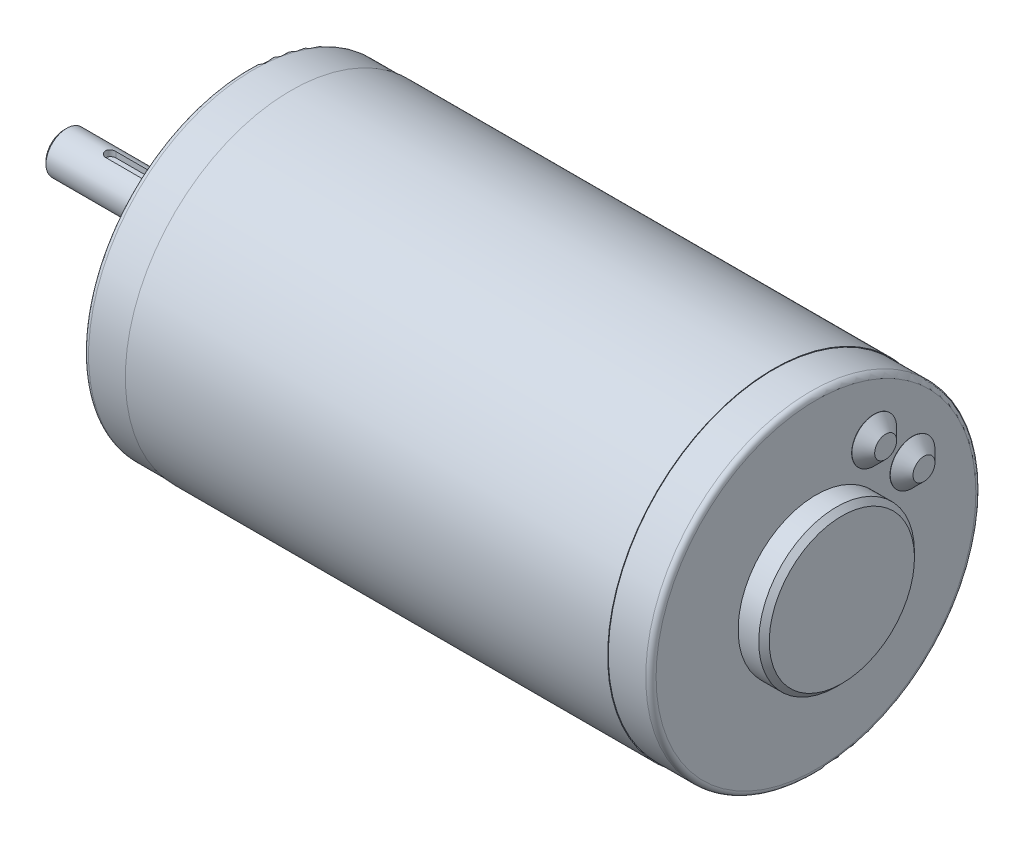
ISO-10303-21;
HEADER;
FILE_DESCRIPTION(('STEP AP214'),'2;1');
FILE_NAME('part.step','',(''),(''),'','','');
FILE_SCHEMA(('AUTOMOTIVE_DESIGN { 1 0 10303 214 1 1 1 1 }'));
ENDSEC;
DATA;
#1=APPLICATION_CONTEXT('core data for automotive mechanical design processes');
#2=APPLICATION_PROTOCOL_DEFINITION('international standard','automotive_design',2000,#1);
#3=PRODUCT_CONTEXT('',#1,'mechanical');
#4=PRODUCT('Part','Part','',(#3));
#5=PRODUCT_RELATED_PRODUCT_CATEGORY('part','',(#4));
#6=PRODUCT_DEFINITION_FORMATION('','',#4);
#7=PRODUCT_DEFINITION_CONTEXT('part definition',#1,'design');
#8=PRODUCT_DEFINITION('design','',#6,#7);
#9=PRODUCT_DEFINITION_SHAPE('','',#8);
#10=(LENGTH_UNIT() NAMED_UNIT(*) SI_UNIT(.MILLI.,.METRE.));
#11=(NAMED_UNIT(*) PLANE_ANGLE_UNIT() SI_UNIT($,.RADIAN.));
#12=(NAMED_UNIT(*) SI_UNIT($,.STERADIAN.) SOLID_ANGLE_UNIT());
#13=UNCERTAINTY_MEASURE_WITH_UNIT(LENGTH_MEASURE(1.E-05),#10,'distance_accuracy_value','');
#14=(GEOMETRIC_REPRESENTATION_CONTEXT(3) GLOBAL_UNCERTAINTY_ASSIGNED_CONTEXT((#13)) GLOBAL_UNIT_ASSIGNED_CONTEXT((#10,
#11,#12)) REPRESENTATION_CONTEXT('',''));
#15=CARTESIAN_POINT('',(0.,0.,0.));
#16=DIRECTION('',(0.,0.,1.));
#17=DIRECTION('',(1.,0.,0.));
#18=AXIS2_PLACEMENT_3D('',#15,#16,#17);
#19=CARTESIAN_POINT('',(-27.6,2.79999999999999,-1.));
#20=DIRECTION('',(0.,-1.,0.));
#21=DIRECTION('',(0.,0.,-1.));
#22=AXIS2_PLACEMENT_3D('',#19,#20,#21);
#23=PLANE('',#22);
#24=CARTESIAN_POINT('',(-7.1,2.79999999999999,0.));
#25=DIRECTION('',(0.,1.,0.));
#26=DIRECTION('',(0.,0.,1.));
#27=AXIS2_PLACEMENT_3D('',#24,#25,#26);
#28=CIRCLE('',#27,1.);
#29=CARTESIAN_POINT('',(-7.1,2.79999999999999,1.));
#30=VERTEX_POINT('',#29);
#31=CARTESIAN_POINT('',(-7.1,2.79999999999999,-1.));
#32=VERTEX_POINT('',#31);
#33=EDGE_CURVE('E81',#30,#32,#28,.T.);
#34=ORIENTED_EDGE('',*,*,#33,.T.);
#35=DIRECTION('',(1.,0.,0.));
#36=VECTOR('',#35,1.);
#37=CARTESIAN_POINT('',(-27.6,2.79999999999999,-1.));
#38=LINE('',#37,#36);
#39=CARTESIAN_POINT('',(-26.6,2.79999999999999,-1.));
#40=VERTEX_POINT('',#39);
#41=EDGE_CURVE('E76',#40,#32,#38,.T.);
#42=ORIENTED_EDGE('',*,*,#41,.F.);
#43=CARTESIAN_POINT('',(-26.6,2.79999999999999,0.));
#44=DIRECTION('',(0.,-1.,0.));
#45=DIRECTION('',(0.,0.,-1.));
#46=AXIS2_PLACEMENT_3D('',#43,#44,#45);
#47=CIRCLE('',#46,1.);
#48=CARTESIAN_POINT('',(-26.6,2.79999999999999,1.));
#49=VERTEX_POINT('',#48);
#50=EDGE_CURVE('E78',#40,#49,#47,.F.);
#51=ORIENTED_EDGE('',*,*,#50,.T.);
#52=DIRECTION('',(1.,0.,0.));
#53=VECTOR('',#52,1.);
#54=CARTESIAN_POINT('',(-27.6,2.79999999999999,1.));
#55=LINE('',#54,#53);
#56=EDGE_CURVE('E104',#49,#30,#55,.T.);
#57=ORIENTED_EDGE('',*,*,#56,.T.);
#58=EDGE_LOOP('',(#34,#42,#51,#57));
#59=FACE_BOUND('',#58,.T.);
#60=ADVANCED_FACE('F18',(#59),#23,.F.);
#61=CARTESIAN_POINT('',(-35.6,0.,0.));
#62=DIRECTION('',(-1.,0.,0.));
#63=DIRECTION('',(0.,0.,1.));
#64=AXIS2_PLACEMENT_3D('',#61,#62,#63);
#65=PLANE('',#64);
#66=CARTESIAN_POINT('',(-35.6000000000449,0.,0.));
#67=DIRECTION('',(1.,0.,0.));
#68=DIRECTION('',(0.,0.,-1.));
#69=AXIS2_PLACEMENT_3D('',#66,#67,#68);
#70=CIRCLE('',#69,3.49999999997408);
#71=CARTESIAN_POINT('',(-35.6000000000449,0.,-3.49999999997408));
#72=VERTEX_POINT('',#71);
#73=EDGE_CURVE('E326',#72,#72,#70,.T.);
#74=ORIENTED_EDGE('',*,*,#73,.F.);
#75=EDGE_LOOP('',(#74));
#76=FACE_BOUND('',#75,.T.);
#77=ADVANCED_FACE('F610',(#76),#65,.T.);
#78=CARTESIAN_POINT('',(-26.6,3.87298334620741,0.));
#79=DIRECTION('',(0.,-1.,0.));
#80=DIRECTION('',(0.,0.,-1.));
#81=AXIS2_PLACEMENT_3D('',#78,#79,#80);
#82=CYLINDRICAL_SURFACE('',#81,1.);
#83=CARTESIAN_POINT('',(-26.6,3.87298334620741,1.));
#84=CARTESIAN_POINT('',(-26.6276629851065,3.87298148580177,1.00000033749611));
#85=CARTESIAN_POINT('',(-26.6553122630182,3.8732800994947,0.998851407375366));
#86=CARTESIAN_POINT('',(-26.7104040353036,3.87445904774558,0.994271295395754));
#87=CARTESIAN_POINT('',(-26.7378465636871,3.87533928441687,0.990840497572679));
#88=CARTESIAN_POINT('',(-26.8194531732088,3.87881710972053,0.977175239382526));
#89=CARTESIAN_POINT('',(-26.8730564684822,3.88225203148808,0.963567695172493));
#90=CARTESIAN_POINT('',(-26.977124673782,3.89095422588002,0.927798076247996));
#91=CARTESIAN_POINT('',(-27.0275898782129,3.89622132630929,0.905636805423835));
#92=CARTESIAN_POINT('',(-27.1241114486473,3.90799134471939,0.853415378025864));
#93=CARTESIAN_POINT('',(-27.170166627891,3.91449459395647,0.823353103356932));
#94=CARTESIAN_POINT('',(-27.2575438819061,3.92816262398025,0.755484471828069));
#95=CARTESIAN_POINT('',(-27.2987548862455,3.93533791028915,0.717537268783975));
#96=CARTESIAN_POINT('',(-27.3743020894827,3.94945104396193,0.635275780516229));
#97=CARTESIAN_POINT('',(-27.4086371894679,3.95638885322537,0.59096047947883));
#98=CARTESIAN_POINT('',(-27.4699110016186,3.96936182283248,0.496456899401689));
#99=CARTESIAN_POINT('',(-27.496739895984,3.9753830468173,0.446195340334472));
#100=CARTESIAN_POINT('',(-27.5415247341967,3.98572346250588,0.341702590842916));
#101=CARTESIAN_POINT('',(-27.5594824242998,3.990042989147,0.287472184083007));
#102=CARTESIAN_POINT('',(-27.5856589927774,3.99641900005128,0.177744108525158));
#103=CARTESIAN_POINT('',(-27.5940676724228,3.998519529013,0.122294322002856));
#104=CARTESIAN_POINT('',(-27.6015033715433,4.00037438150815,0.0107327756816781));
#105=CARTESIAN_POINT('',(-27.6005315701923,4.00012899993444,-0.0453789000287067));
#106=CARTESIAN_POINT('',(-27.5893700363146,3.99735237365735,-0.155352492972096));
#107=CARTESIAN_POINT('',(-27.5793853834005,3.9948719867736,-0.209236701739855));
#108=CARTESIAN_POINT('',(-27.5508113208173,3.98796330636495,-0.31453871108434));
#109=CARTESIAN_POINT('',(-27.5322215304314,3.98353492665556,-0.365956402423988));
#110=CARTESIAN_POINT('',(-27.4867987193294,3.97314997761798,-0.46540728602454));
#111=CARTESIAN_POINT('',(-27.4598926057672,3.96717993827555,-0.513405629602248));
#112=CARTESIAN_POINT('',(-27.3986568701665,3.95435945541919,-0.604276631230015));
#113=CARTESIAN_POINT('',(-27.3643261297468,3.94750887933198,-0.64714851556229));
#114=CARTESIAN_POINT('',(-27.2881210879187,3.93345566022865,-0.727769389708492));
#115=CARTESIAN_POINT('',(-27.2460683634602,3.92624850477685,-0.765349103054128));
#116=CARTESIAN_POINT('',(-27.1561701330723,3.91246168284006,-0.832969575186237));
#117=CARTESIAN_POINT('',(-27.1083230467164,3.90588218842993,-0.863008270245062));
#118=CARTESIAN_POINT('',(-27.0078544021762,3.89407813586325,-0.914804709285961));
#119=CARTESIAN_POINT('',(-26.9552085351039,3.88886106009136,-0.936517017887269));
#120=CARTESIAN_POINT('',(-26.8468830715817,3.88047058807054,-0.970702351849828));
#121=CARTESIAN_POINT('',(-26.7912081448502,3.87729413761435,-0.983189189212131));
#122=CARTESIAN_POINT('',(-26.7125426192411,3.87455290681524,-0.993904635150938));
#123=CARTESIAN_POINT('',(-26.6900802967868,3.87396523110859,-0.996190790966708));
#124=CARTESIAN_POINT('',(-26.6450822100907,3.87318062488974,-0.999236757697394));
#125=CARTESIAN_POINT('',(-26.6225466240447,3.87298306219461,-0.999999038096045));
#126=CARTESIAN_POINT('',(-26.6,3.87298334620741,-1.));
#127=B_SPLINE_CURVE_WITH_KNOTS('',3,(#83,#84,#85,#86,#87,#88,#89,#90,#91,#92,#93,#94,#95,#96,
#97,#98,#99,#100,#101,#102,#103,#104,#105,#106,#107,#108,#109,#110,#111,#112,#113,#114,#115,
#116,#117,#118,#119,#120,#121,#122,#123,#124,#125,#126),.UNSPECIFIED.,.F.,.F.,(4,2,2,2,2,2,2,2,
2,2,2,2,2,2,2,2,2,2,2,2,2,4),(0.,0.0829365303397727,0.165859106084653,0.331229963080318,
0.496585282091499,0.661984974726751,0.830641897427976,0.999325753539196,1.17036187098235,
1.34136430732425,1.50890481515325,1.67642426256639,1.84022545479276,2.00403389475838,
2.16932509450376,2.33464120964329,2.50441429534542,2.67423379180967,2.84496720161068,
3.01544447539986,3.08315848722649,3.15076267731671),.UNSPECIFIED.);
#128=CARTESIAN_POINT('',(-26.6,3.87298334620741,1.));
#129=VERTEX_POINT('',#128);
#130=CARTESIAN_POINT('',(-26.6,3.87298334620741,-1.));
#131=VERTEX_POINT('',#130);
#132=EDGE_CURVE('E162',#129,#131,#127,.T.);
#133=ORIENTED_EDGE('',*,*,#132,.F.);
#134=DIRECTION('',(0.,1.,0.));
#135=VECTOR('',#134,1.);
#136=CARTESIAN_POINT('',(-26.6,2.79999999999999,1.));
#137=LINE('',#136,#135);
#138=EDGE_CURVE('E91',#129,#49,#137,.F.);
#139=ORIENTED_EDGE('',*,*,#138,.T.);
#140=ORIENTED_EDGE('',*,*,#50,.F.);
#141=DIRECTION('',(0.,1.,0.));
#142=VECTOR('',#141,1.);
#143=CARTESIAN_POINT('',(-26.6,2.79999999999999,-1.));
#144=LINE('',#143,#142);
#145=EDGE_CURVE('E85',#131,#40,#144,.F.);
#146=ORIENTED_EDGE('',*,*,#145,.F.);
#147=EDGE_LOOP('',(#133,#139,#140,#146));
#148=FACE_BOUND('',#147,.T.);
#149=ADVANCED_FACE('F88',(#148),#82,.F.);
#150=CARTESIAN_POINT('',(-27.6,2.79999999999999,-1.));
#151=DIRECTION('',(0.,0.,1.));
#152=DIRECTION('',(1.,0.,0.));
#153=AXIS2_PLACEMENT_3D('',#150,#151,#152);
#154=PLANE('',#153);
#155=DIRECTION('',(1.,0.,0.));
#156=VECTOR('',#155,1.);
#157=CARTESIAN_POINT('',(0.,3.87298334620741,-1.));
#158=LINE('',#157,#156);
#159=CARTESIAN_POINT('',(-7.1,3.87298334620741,-1.));
#160=VERTEX_POINT('',#159);
#161=EDGE_CURVE('E96',#131,#160,#158,.T.);
#162=ORIENTED_EDGE('',*,*,#161,.F.);
#163=ORIENTED_EDGE('',*,*,#145,.T.);
#164=ORIENTED_EDGE('',*,*,#41,.T.);
#165=DIRECTION('',(0.,1.,0.));
#166=VECTOR('',#165,1.);
#167=CARTESIAN_POINT('',(-7.1,2.79999999999999,-1.));
#168=LINE('',#167,#166);
#169=EDGE_CURVE('E99',#32,#160,#168,.T.);
#170=ORIENTED_EDGE('',*,*,#169,.T.);
#171=EDGE_LOOP('',(#162,#163,#164,#170));
#172=FACE_BOUND('',#171,.T.);
#173=ADVANCED_FACE('F94',(#172),#154,.T.);
#174=CARTESIAN_POINT('',(-7.1,2.79999999999999,0.));
#175=DIRECTION('',(0.,1.,0.));
#176=DIRECTION('',(0.,0.,1.));
#177=AXIS2_PLACEMENT_3D('',#174,#175,#176);
#178=CYLINDRICAL_SURFACE('',#177,1.);
#179=ORIENTED_EDGE('',*,*,#33,.F.);
#180=DIRECTION('',(0.,1.,0.));
#181=VECTOR('',#180,1.);
#182=CARTESIAN_POINT('',(-7.1,2.79999999999999,1.));
#183=LINE('',#182,#181);
#184=CARTESIAN_POINT('',(-7.1,3.87298334620741,1.));
#185=VERTEX_POINT('',#184);
#186=EDGE_CURVE('E105',#30,#185,#183,.T.);
#187=ORIENTED_EDGE('',*,*,#186,.T.);
#188=CARTESIAN_POINT('',(-7.1,3.87298334620741,-1.));
#189=CARTESIAN_POINT('',(-7.07233701489346,3.87298148580177,-1.00000033749611));
#190=CARTESIAN_POINT('',(-7.04468773698177,3.8732800994947,-0.998851407375366));
#191=CARTESIAN_POINT('',(-6.98959596469644,3.87445904774558,-0.994271295395754));
#192=CARTESIAN_POINT('',(-6.96215343631291,3.87533928441687,-0.990840497572679));
#193=CARTESIAN_POINT('',(-6.88054682679116,3.87881710972053,-0.977175239382526));
#194=CARTESIAN_POINT('',(-6.82694353151779,3.88225203148808,-0.963567695172493));
#195=CARTESIAN_POINT('',(-6.72287532621804,3.89095422588002,-0.927798076247997));
#196=CARTESIAN_POINT('',(-6.67241012178714,3.89622132630929,-0.905636805423836));
#197=CARTESIAN_POINT('',(-6.57588855135267,3.90799134471939,-0.853415378025865));
#198=CARTESIAN_POINT('',(-6.52983337210904,3.91449459395647,-0.823353103356933));
#199=CARTESIAN_POINT('',(-6.4424561180939,3.92816262398025,-0.755484471828069));
#200=CARTESIAN_POINT('',(-6.40124511375448,3.93533791028915,-0.717537268783976));
#201=CARTESIAN_POINT('',(-6.32569791051729,3.94945104396193,-0.63527578051623));
#202=CARTESIAN_POINT('',(-6.29136281053206,3.95638885322537,-0.590960479478831));
#203=CARTESIAN_POINT('',(-6.23008899838136,3.96936182283248,-0.496456899401691));
#204=CARTESIAN_POINT('',(-6.20326010401603,3.9753830468173,-0.446195340334474));
#205=CARTESIAN_POINT('',(-6.1584752658033,3.98572346250588,-0.341702590842919));
#206=CARTESIAN_POINT('',(-6.14051757570017,3.990042989147,-0.28747218408301));
#207=CARTESIAN_POINT('',(-6.11434100722257,3.99641900005128,-0.17774410852516));
#208=CARTESIAN_POINT('',(-6.10593232757718,3.998519529013,-0.122294322002858));
#209=CARTESIAN_POINT('',(-6.09849662845671,4.00037438150815,-0.0107327756816796));
#210=CARTESIAN_POINT('',(-6.09946842980766,4.00012899993444,0.0453789000287057));
#211=CARTESIAN_POINT('',(-6.11062996368545,3.99735237365735,0.155352492972096));
#212=CARTESIAN_POINT('',(-6.12061461659948,3.9948719867736,0.209236701739855));
#213=CARTESIAN_POINT('',(-6.14918867918275,3.98796330636495,0.31453871108434));
#214=CARTESIAN_POINT('',(-6.16777846956858,3.98353492665556,0.365956402423988));
#215=CARTESIAN_POINT('',(-6.21320128067065,3.97314997761798,0.465407286024539));
#216=CARTESIAN_POINT('',(-6.24010739423284,3.96717993827555,0.513405629602248));
#217=CARTESIAN_POINT('',(-6.30134312983347,3.95435945541919,0.604276631230014));
#218=CARTESIAN_POINT('',(-6.33567387025322,3.94750887933198,0.647148515562289));
#219=CARTESIAN_POINT('',(-6.41187891208131,3.93345566022865,0.72776938970849));
#220=CARTESIAN_POINT('',(-6.45393163653981,3.92624850477685,0.765349103054127));
#221=CARTESIAN_POINT('',(-6.54382986692773,3.91246168284006,0.832969575186237));
#222=CARTESIAN_POINT('',(-6.59167695328356,3.90588218842993,0.863008270245062));
#223=CARTESIAN_POINT('',(-6.69214559782377,3.89407813586325,0.914804709285962));
#224=CARTESIAN_POINT('',(-6.74479146489609,3.88886106009136,0.936517017887269));
#225=CARTESIAN_POINT('',(-6.85311692841829,3.88047058807055,0.970702351849829));
#226=CARTESIAN_POINT('',(-6.90879185514984,3.87729413761435,0.983189189212132));
#227=CARTESIAN_POINT('',(-6.9874573807589,3.87455290681524,0.993904635150938));
#228=CARTESIAN_POINT('',(-7.00991970321318,3.87396523110859,0.996190790966708));
#229=CARTESIAN_POINT('',(-7.05491778990932,3.87318062488974,0.999236757697394));
#230=CARTESIAN_POINT('',(-7.07745337595529,3.87298306219461,0.999999038096045));
#231=CARTESIAN_POINT('',(-7.1,3.87298334620741,1.));
#232=B_SPLINE_CURVE_WITH_KNOTS('',3,(#188,#189,#190,#191,#192,#193,#194,#195,#196,#197,#198,
#199,#200,#201,#202,#203,#204,#205,#206,#207,#208,#209,#210,#211,#212,#213,#214,#215,#216,#217,
#218,#219,#220,#221,#222,#223,#224,#225,#226,#227,#228,#229,#230,#231),.UNSPECIFIED.,.F.,.F.,(4,
2,2,2,2,2,2,2,2,2,2,2,2,2,2,2,2,2,2,2,2,4),(0.,0.0829365303397693,0.165859106084651,
0.331229963080317,0.496585282091498,0.661984974726749,0.830641897427974,0.999325753539193,
1.17036187098235,1.34136430732424,1.50890481515325,1.67642426256639,1.84022545479276,
2.00403389475838,2.16932509450376,2.33464120964329,2.50441429534542,2.67423379180967,
2.84496720161068,3.01544447539986,3.08315848722648,3.15076267731671),.UNSPECIFIED.);
#233=EDGE_CURVE('E153',#160,#185,#232,.T.);
#234=ORIENTED_EDGE('',*,*,#233,.F.);
#235=ORIENTED_EDGE('',*,*,#169,.F.);
#236=EDGE_LOOP('',(#179,#187,#234,#235));
#237=FACE_BOUND('',#236,.T.);
#238=ADVANCED_FACE('F168',(#237),#178,.F.);
#239=CARTESIAN_POINT('',(-27.6,2.79999999999999,1.));
#240=DIRECTION('',(0.,0.,1.));
#241=DIRECTION('',(1.,0.,0.));
#242=AXIS2_PLACEMENT_3D('',#239,#240,#241);
#243=PLANE('',#242);
#244=ORIENTED_EDGE('',*,*,#186,.F.);
#245=ORIENTED_EDGE('',*,*,#56,.F.);
#246=ORIENTED_EDGE('',*,*,#138,.F.);
#247=DIRECTION('',(1.,0.,0.));
#248=VECTOR('',#247,1.);
#249=CARTESIAN_POINT('',(0.,3.87298334620741,1.));
#250=LINE('',#249,#248);
#251=EDGE_CURVE('E161',#185,#129,#250,.F.);
#252=ORIENTED_EDGE('',*,*,#251,.F.);
#253=EDGE_LOOP('',(#244,#245,#246,#252));
#254=FACE_BOUND('',#253,.T.);
#255=ADVANCED_FACE('F183',(#254),#243,.F.);
#256=CARTESIAN_POINT('',(-35.0999999999999,0.,0.));
#257=DIRECTION('',(1.,0.,0.));
#258=DIRECTION('',(0.,0.,-1.));
#259=AXIS2_PLACEMENT_3D('',#256,#257,#258);
#260=CONICAL_SURFACE('',#259,3.99999999996226,0.785398163340605);
#261=ORIENTED_EDGE('',*,*,#73,.T.);
#262=EDGE_LOOP('',(#261));
#263=FACE_BOUND('',#262,.T.);
#264=CARTESIAN_POINT('',(-35.1,0.,0.));
#265=DIRECTION('',(1.,0.,0.));
#266=DIRECTION('',(0.,0.,-1.));
#267=AXIS2_PLACEMENT_3D('',#264,#265,#266);
#268=CIRCLE('',#267,4.);
#269=CARTESIAN_POINT('',(-35.1,0.,-4.));
#270=VERTEX_POINT('',#269);
#271=EDGE_CURVE('E152',#270,#270,#268,.T.);
#272=ORIENTED_EDGE('',*,*,#271,.F.);
#273=EDGE_LOOP('',(#272));
#274=FACE_BOUND('',#273,.T.);
#275=ADVANCED_FACE('F178',(#263,#274),#260,.T.);
#276=CARTESIAN_POINT('',(0.,0.,0.));
#277=DIRECTION('',(1.,0.,0.));
#278=DIRECTION('',(0.,0.,-1.));
#279=AXIS2_PLACEMENT_3D('',#276,#277,#278);
#280=CYLINDRICAL_SURFACE('',#279,4.);
#281=ORIENTED_EDGE('',*,*,#271,.T.);
#282=EDGE_LOOP('',(#281));
#283=FACE_BOUND('',#282,.T.);
#284=CARTESIAN_POINT('',(-4.,0.,0.));
#285=DIRECTION('',(1.,0.,0.));
#286=DIRECTION('',(0.,0.,-1.));
#287=AXIS2_PLACEMENT_3D('',#284,#285,#286);
#288=CIRCLE('',#287,4.);
#289=CARTESIAN_POINT('',(-4.,0.,-4.));
#290=VERTEX_POINT('',#289);
#291=EDGE_CURVE('E149',#290,#290,#288,.T.);
#292=ORIENTED_EDGE('',*,*,#291,.F.);
#293=EDGE_LOOP('',(#292));
#294=FACE_BOUND('',#293,.T.);
#295=ORIENTED_EDGE('',*,*,#233,.T.);
#296=ORIENTED_EDGE('',*,*,#251,.T.);
#297=ORIENTED_EDGE('',*,*,#132,.T.);
#298=ORIENTED_EDGE('',*,*,#161,.T.);
#299=EDGE_LOOP('',(#295,#296,#297,#298));
#300=FACE_BOUND('',#299,.T.);
#301=ADVANCED_FACE('F172',(#283,#294,#300),#280,.T.);
#302=CARTESIAN_POINT('',(-4.,4.,0.));
#303=DIRECTION('',(-1.,0.,0.));
#304=DIRECTION('',(0.,0.,1.));
#305=AXIS2_PLACEMENT_3D('',#302,#303,#304);
#306=PLANE('',#305);
#307=ORIENTED_EDGE('',*,*,#291,.T.);
#308=EDGE_LOOP('',(#307));
#309=FACE_BOUND('',#308,.T.);
#310=CARTESIAN_POINT('',(-4.,0.,0.));
#311=DIRECTION('',(1.,0.,0.));
#312=DIRECTION('',(0.,1.,0.));
#313=AXIS2_PLACEMENT_3D('',#310,#311,#312);
#314=CIRCLE('',#313,8.509);
#315=CARTESIAN_POINT('',(-4.,8.509,0.));
#316=VERTEX_POINT('',#315);
#317=EDGE_CURVE('E146',#316,#316,#314,.T.);
#318=ORIENTED_EDGE('',*,*,#317,.F.);
#319=EDGE_LOOP('',(#318));
#320=FACE_BOUND('',#319,.T.);
#321=ADVANCED_FACE('F177',(#309,#320),#306,.T.);
#322=CARTESIAN_POINT('',(111.8479,18.6070906828553,-11.2073596390943));
#323=DIRECTION('',(1.,0.,0.));
#324=DIRECTION('',(0.,0.,-1.));
#325=AXIS2_PLACEMENT_3D('',#322,#323,#324);
#326=PLANE('',#325);
#327=CARTESIAN_POINT('',(111.84789999993,18.6070906828553,-11.2073596390943));
#328=DIRECTION('',(-1.,0.,0.));
#329=DIRECTION('',(0.,-1.,0.));
#330=AXIS2_PLACEMENT_3D('',#327,#328,#329);
#331=CIRCLE('',#330,2.11800000003146);
#332=CARTESIAN_POINT('',(111.84789999993,16.4890906828238,-11.2073596390943));
#333=VERTEX_POINT('',#332);
#334=EDGE_CURVE('E143',#333,#333,#331,.T.);
#335=ORIENTED_EDGE('',*,*,#334,.F.);
#336=EDGE_LOOP('',(#335));
#337=FACE_BOUND('',#336,.T.);
#338=ADVANCED_FACE('F456',(#337),#326,.T.);
#339=CARTESIAN_POINT('',(114.6,15.0368,0.));
#340=DIRECTION('',(1.,0.,0.));
#341=DIRECTION('',(0.,0.,-1.));
#342=AXIS2_PLACEMENT_3D('',#339,#340,#341);
#343=PLANE('',#342);
#344=CARTESIAN_POINT('',(114.6,0.,0.));
#345=DIRECTION('',(-1.,0.,0.));
#346=DIRECTION('',(0.,-1.,0.));
#347=AXIS2_PLACEMENT_3D('',#344,#345,#346);
#348=CIRCLE('',#347,14.0208);
#349=CARTESIAN_POINT('',(114.6,-14.0208,0.));
#350=VERTEX_POINT('',#349);
#351=EDGE_CURVE('E140',#350,#350,#348,.T.);
#352=ORIENTED_EDGE('',*,*,#351,.F.);
#353=EDGE_LOOP('',(#352));
#354=FACE_BOUND('',#353,.T.);
#355=ADVANCED_FACE('F446',(#354),#343,.T.);
#356=CARTESIAN_POINT('',(111.8479,11.2073596390943,-18.6070906828553));
#357=DIRECTION('',(1.,0.,0.));
#358=DIRECTION('',(0.,0.,-1.));
#359=AXIS2_PLACEMENT_3D('',#356,#357,#358);
#360=PLANE('',#359);
#361=CARTESIAN_POINT('',(111.84789999993,11.2073596390943,-18.6070906828553));
#362=DIRECTION('',(-1.,0.,0.));
#363=DIRECTION('',(0.,0.,1.));
#364=AXIS2_PLACEMENT_3D('',#361,#362,#363);
#365=CIRCLE('',#364,2.1180000000021);
#366=CARTESIAN_POINT('',(111.84789999993,11.2073596390943,-16.4890906828532));
#367=VERTEX_POINT('',#366);
#368=EDGE_CURVE('E136',#367,#367,#365,.T.);
#369=ORIENTED_EDGE('',*,*,#368,.F.);
#370=EDGE_LOOP('',(#369));
#371=FACE_BOUND('',#370,.T.);
#372=ADVANCED_FACE('F440',(#371),#360,.T.);
#373=CARTESIAN_POINT('',(13.6143999999945,25.4,0.));
#374=DIRECTION('',(-1.,0.,0.));
#375=DIRECTION('',(0.,0.,1.));
#376=AXIS2_PLACEMENT_3D('',#373,#374,#375);
#377=CONICAL_SURFACE('',#376,2.01929999997219,1.02974425867198);
#378=CARTESIAN_POINT('',(14.827717847993,25.4,0.));
#379=VERTEX_POINT('',#378);
#380=VERTEX_LOOP('',#379);
#381=FACE_BOUND('',#380,.T.);
#382=CARTESIAN_POINT('',(13.6144,25.4,0.));
#383=DIRECTION('',(-1.,0.,0.));
#384=DIRECTION('',(0.,0.,1.));
#385=AXIS2_PLACEMENT_3D('',#382,#383,#384);
#386=CIRCLE('',#385,2.0193);
#387=CARTESIAN_POINT('',(13.6144,25.4,2.0193));
#388=VERTEX_POINT('',#387);
#389=EDGE_CURVE('E139',#388,#388,#386,.T.);
#390=ORIENTED_EDGE('',*,*,#389,.T.);
#391=EDGE_LOOP('',(#390));
#392=FACE_BOUND('',#391,.T.);
#393=ADVANCED_FACE('F445',(#381,#392),#377,.F.);
#394=CARTESIAN_POINT('',(13.6143999999945,-25.4,0.));
#395=DIRECTION('',(-1.,0.,0.));
#396=DIRECTION('',(0.,0.,1.));
#397=AXIS2_PLACEMENT_3D('',#394,#395,#396);
#398=CONICAL_SURFACE('',#397,2.01929999997219,1.02974425867198);
#399=CARTESIAN_POINT('',(14.827717847993,-25.4,0.));
#400=VERTEX_POINT('',#399);
#401=VERTEX_LOOP('',#400);
#402=FACE_BOUND('',#401,.T.);
#403=CARTESIAN_POINT('',(13.6144,-25.4,0.));
#404=DIRECTION('',(-1.,0.,0.));
#405=DIRECTION('',(0.,0.,1.));
#406=AXIS2_PLACEMENT_3D('',#403,#404,#405);
#407=CIRCLE('',#406,2.0193);
#408=CARTESIAN_POINT('',(13.6144,-25.4,2.0193));
#409=VERTEX_POINT('',#408);
#410=EDGE_CURVE('E316',#409,#409,#407,.T.);
#411=ORIENTED_EDGE('',*,*,#410,.T.);
#412=EDGE_LOOP('',(#411));
#413=FACE_BOUND('',#412,.T.);
#414=ADVANCED_FACE('F504',(#402,#413),#398,.F.);
#415=CARTESIAN_POINT('',(-2.984,0.,0.));
#416=DIRECTION('',(1.,0.,0.));
#417=DIRECTION('',(0.,1.,0.));
#418=AXIS2_PLACEMENT_3D('',#415,#416,#417);
#419=CONICAL_SURFACE('',#418,9.525,0.78539816339745);
#420=ORIENTED_EDGE('',*,*,#317,.T.);
#421=EDGE_LOOP('',(#420));
#422=FACE_BOUND('',#421,.T.);
#423=CARTESIAN_POINT('',(-2.984,0.,0.));
#424=DIRECTION('',(1.,0.,0.));
#425=DIRECTION('',(0.,0.,-1.));
#426=AXIS2_PLACEMENT_3D('',#423,#424,#425);
#427=CIRCLE('',#426,9.525);
#428=CARTESIAN_POINT('',(-2.984,0.,-9.525));
#429=VERTEX_POINT('',#428);
#430=EDGE_CURVE('E313',#429,#429,#427,.T.);
#431=ORIENTED_EDGE('',*,*,#430,.F.);
#432=EDGE_LOOP('',(#431));
#433=FACE_BOUND('',#432,.T.);
#434=ADVANCED_FACE('F432',(#422,#433),#419,.T.);
#435=CARTESIAN_POINT('',(109.647900000027,18.6070906828553,-11.2073596390943));
#436=DIRECTION('',(-1.,0.,0.));
#437=DIRECTION('',(0.,-1.,0.));
#438=AXIS2_PLACEMENT_3D('',#435,#436,#437);
#439=CONICAL_SURFACE('',#438,4.31799999987712,0.785398163384529);
#440=CARTESIAN_POINT('',(109.6479,18.6070906828553,-11.2073596390943));
#441=DIRECTION('',(-1.,0.,0.));
#442=DIRECTION('',(0.,0.,1.));
#443=AXIS2_PLACEMENT_3D('',#440,#441,#442);
#444=CIRCLE('',#443,4.318);
#445=CARTESIAN_POINT('',(109.6479,18.6070906828553,-6.88935963909434));
#446=VERTEX_POINT('',#445);
#447=EDGE_CURVE('E310',#446,#446,#444,.T.);
#448=ORIENTED_EDGE('',*,*,#447,.F.);
#449=EDGE_LOOP('',(#448));
#450=FACE_BOUND('',#449,.T.);
#451=ORIENTED_EDGE('',*,*,#334,.T.);
#452=EDGE_LOOP('',(#451));
#453=FACE_BOUND('',#452,.T.);
#454=ADVANCED_FACE('F427',(#450,#453),#439,.T.);
#455=CARTESIAN_POINT('',(113.584,0.,0.));
#456=DIRECTION('',(-1.,0.,0.));
#457=DIRECTION('',(0.,-1.,0.));
#458=AXIS2_PLACEMENT_3D('',#455,#456,#457);
#459=CONICAL_SURFACE('',#458,15.0368,0.785398163397441);
#460=ORIENTED_EDGE('',*,*,#351,.T.);
#461=EDGE_LOOP('',(#460));
#462=FACE_BOUND('',#461,.T.);
#463=CARTESIAN_POINT('',(113.584,0.,0.));
#464=DIRECTION('',(1.,0.,0.));
#465=DIRECTION('',(0.,0.,-1.));
#466=AXIS2_PLACEMENT_3D('',#463,#464,#465);
#467=CIRCLE('',#466,15.0368);
#468=CARTESIAN_POINT('',(113.584,0.,-15.0368));
#469=VERTEX_POINT('',#468);
#470=EDGE_CURVE('E307',#469,#469,#467,.F.);
#471=ORIENTED_EDGE('',*,*,#470,.F.);
#472=EDGE_LOOP('',(#471));
#473=FACE_BOUND('',#472,.T.);
#474=ADVANCED_FACE('F417',(#462,#473),#459,.T.);
#475=CARTESIAN_POINT('',(109.647900000084,11.2073596390943,-18.6070906828553));
#476=DIRECTION('',(-1.,0.,0.));
#477=DIRECTION('',(0.,0.,1.));
#478=AXIS2_PLACEMENT_3D('',#475,#476,#477);
#479=CONICAL_SURFACE('',#478,4.31799999990461,0.785398163410367);
#480=CARTESIAN_POINT('',(109.6479,11.2073596390943,-18.6070906828553));
#481=DIRECTION('',(-1.,0.,0.));
#482=DIRECTION('',(0.,0.,1.));
#483=AXIS2_PLACEMENT_3D('',#480,#481,#482);
#484=CIRCLE('',#483,4.318);
#485=CARTESIAN_POINT('',(109.6479,11.2073596390943,-14.2890906828553));
#486=VERTEX_POINT('',#485);
#487=EDGE_CURVE('E135',#486,#486,#484,.T.);
#488=ORIENTED_EDGE('',*,*,#487,.F.);
#489=EDGE_LOOP('',(#488));
#490=FACE_BOUND('',#489,.T.);
#491=ORIENTED_EDGE('',*,*,#368,.T.);
#492=EDGE_LOOP('',(#491));
#493=FACE_BOUND('',#492,.T.);
#494=ADVANCED_FACE('F411',(#490,#493),#479,.T.);
#495=CARTESIAN_POINT('',(0.,25.4,0.));
#496=DIRECTION('',(-1.,0.,0.));
#497=DIRECTION('',(0.,0.,1.));
#498=AXIS2_PLACEMENT_3D('',#495,#496,#497);
#499=CYLINDRICAL_SURFACE('',#498,2.0193);
#500=CARTESIAN_POINT('',(0.,25.4,0.));
#501=DIRECTION('',(-1.,0.,0.));
#502=DIRECTION('',(0.,0.,1.));
#503=AXIS2_PLACEMENT_3D('',#500,#501,#502);
#504=CIRCLE('',#503,2.0193);
#505=CARTESIAN_POINT('',(0.,25.4,2.0193));
#506=VERTEX_POINT('',#505);
#507=EDGE_CURVE('E132',#506,#506,#504,.F.);
#508=ORIENTED_EDGE('',*,*,#507,.F.);
#509=EDGE_LOOP('',(#508));
#510=FACE_BOUND('',#509,.T.);
#511=ORIENTED_EDGE('',*,*,#389,.F.);
#512=EDGE_LOOP('',(#511));
#513=FACE_BOUND('',#512,.T.);
#514=ADVANCED_FACE('F416',(#510,#513),#499,.F.);
#515=CARTESIAN_POINT('',(0.,-25.4,0.));
#516=DIRECTION('',(-1.,0.,0.));
#517=DIRECTION('',(0.,0.,1.));
#518=AXIS2_PLACEMENT_3D('',#515,#516,#517);
#519=CYLINDRICAL_SURFACE('',#518,2.0193);
#520=CARTESIAN_POINT('',(0.,-25.4,0.));
#521=DIRECTION('',(-1.,0.,0.));
#522=DIRECTION('',(0.,0.,1.));
#523=AXIS2_PLACEMENT_3D('',#520,#521,#522);
#524=CIRCLE('',#523,2.0193);
#525=CARTESIAN_POINT('',(0.,-25.4,2.0193));
#526=VERTEX_POINT('',#525);
#527=EDGE_CURVE('E129',#526,#526,#524,.F.);
#528=ORIENTED_EDGE('',*,*,#527,.F.);
#529=EDGE_LOOP('',(#528));
#530=FACE_BOUND('',#529,.T.);
#531=ORIENTED_EDGE('',*,*,#410,.F.);
#532=EDGE_LOOP('',(#531));
#533=FACE_BOUND('',#532,.T.);
#534=ADVANCED_FACE('F514',(#530,#533),#519,.F.);
#535=CARTESIAN_POINT('',(0.,0.,0.));
#536=DIRECTION('',(1.,0.,0.));
#537=DIRECTION('',(0.,0.,-1.));
#538=AXIS2_PLACEMENT_3D('',#535,#536,#537);
#539=CYLINDRICAL_SURFACE('',#538,9.525);
#540=ORIENTED_EDGE('',*,*,#430,.T.);
#541=EDGE_LOOP('',(#540));
#542=FACE_BOUND('',#541,.T.);
#543=CARTESIAN_POINT('',(0.,0.,0.));
#544=DIRECTION('',(1.,0.,0.));
#545=DIRECTION('',(0.,0.,-1.));
#546=AXIS2_PLACEMENT_3D('',#543,#544,#545);
#547=CIRCLE('',#546,9.525);
#548=CARTESIAN_POINT('',(0.,0.,-9.525));
#549=VERTEX_POINT('',#548);
#550=EDGE_CURVE('E126',#549,#549,#547,.T.);
#551=ORIENTED_EDGE('',*,*,#550,.F.);
#552=EDGE_LOOP('',(#551));
#553=FACE_BOUND('',#552,.T.);
#554=ADVANCED_FACE('F403',(#542,#553),#539,.T.);
#555=CARTESIAN_POINT('',(111.8479,18.6070906828553,-11.2073596390943));
#556=DIRECTION('',(-1.,0.,0.));
#557=DIRECTION('',(0.,0.,1.));
#558=AXIS2_PLACEMENT_3D('',#555,#556,#557);
#559=CYLINDRICAL_SURFACE('',#558,4.318);
#560=CARTESIAN_POINT('',(109.6,18.6070906828553,-11.2073596390943));
#561=DIRECTION('',(-1.,0.,0.));
#562=DIRECTION('',(0.,0.,1.));
#563=AXIS2_PLACEMENT_3D('',#560,#561,#562);
#564=CIRCLE('',#563,4.318);
#565=CARTESIAN_POINT('',(109.6,18.6070906828553,-6.88935963909434));
#566=VERTEX_POINT('',#565);
#567=EDGE_CURVE('E123',#566,#566,#564,.T.);
#568=ORIENTED_EDGE('',*,*,#567,.F.);
#569=EDGE_LOOP('',(#568));
#570=FACE_BOUND('',#569,.T.);
#571=ORIENTED_EDGE('',*,*,#447,.T.);
#572=EDGE_LOOP('',(#571));
#573=FACE_BOUND('',#572,.T.);
#574=ADVANCED_FACE('F398',(#570,#573),#559,.T.);
#575=CARTESIAN_POINT('',(0.,0.,0.));
#576=DIRECTION('',(1.,0.,0.));
#577=DIRECTION('',(0.,0.,-1.));
#578=AXIS2_PLACEMENT_3D('',#575,#576,#577);
#579=CYLINDRICAL_SURFACE('',#578,15.0368);
#580=CARTESIAN_POINT('',(109.6,0.,0.));
#581=DIRECTION('',(1.,0.,0.));
#582=DIRECTION('',(0.,0.,-1.));
#583=AXIS2_PLACEMENT_3D('',#580,#581,#582);
#584=CIRCLE('',#583,15.0368);
#585=CARTESIAN_POINT('',(109.6,0.,-15.0368));
#586=VERTEX_POINT('',#585);
#587=EDGE_CURVE('E120',#586,#586,#584,.F.);
#588=ORIENTED_EDGE('',*,*,#587,.F.);
#589=EDGE_LOOP('',(#588));
#590=FACE_BOUND('',#589,.T.);
#591=ORIENTED_EDGE('',*,*,#470,.T.);
#592=EDGE_LOOP('',(#591));
#593=FACE_BOUND('',#592,.T.);
#594=ADVANCED_FACE('F390',(#590,#593),#579,.T.);
#595=CARTESIAN_POINT('',(111.8479,11.2073596390943,-18.6070906828553));
#596=DIRECTION('',(-1.,0.,0.));
#597=DIRECTION('',(0.,0.,1.));
#598=AXIS2_PLACEMENT_3D('',#595,#596,#597);
#599=CYLINDRICAL_SURFACE('',#598,4.318);
#600=CARTESIAN_POINT('',(109.6,11.2073596390943,-18.6070906828553));
#601=DIRECTION('',(-1.,0.,0.));
#602=DIRECTION('',(0.,0.,1.));
#603=AXIS2_PLACEMENT_3D('',#600,#601,#602);
#604=CIRCLE('',#603,4.318);
#605=CARTESIAN_POINT('',(109.6,11.2073596390943,-14.2890906828553));
#606=VERTEX_POINT('',#605);
#607=EDGE_CURVE('E116',#606,#606,#604,.T.);
#608=ORIENTED_EDGE('',*,*,#607,.F.);
#609=EDGE_LOOP('',(#608));
#610=FACE_BOUND('',#609,.T.);
#611=ORIENTED_EDGE('',*,*,#487,.T.);
#612=EDGE_LOOP('',(#611));
#613=FACE_BOUND('',#612,.T.);
#614=ADVANCED_FACE('F385',(#610,#613),#599,.T.);
#615=CARTESIAN_POINT('',(0.,9.525,0.));
#616=DIRECTION('',(-1.,0.,0.));
#617=DIRECTION('',(0.,0.,1.));
#618=AXIS2_PLACEMENT_3D('',#615,#616,#617);
#619=PLANE('',#618);
#620=ORIENTED_EDGE('',*,*,#550,.T.);
#621=EDGE_LOOP('',(#620));
#622=FACE_BOUND('',#621,.T.);
#623=CARTESIAN_POINT('',(0.,0.,0.));
#624=DIRECTION('',(1.,0.,0.));
#625=DIRECTION('',(0.,0.,-1.));
#626=AXIS2_PLACEMENT_3D('',#623,#624,#625);
#627=CIRCLE('',#626,30.877);
#628=CARTESIAN_POINT('',(0.,0.,-30.877));
#629=VERTEX_POINT('',#628);
#630=CARTESIAN_POINT('',(0.,0.,30.877));
#631=VERTEX_POINT('',#630);
#632=EDGE_CURVE('E119',#629,#631,#627,.T.);
#633=ORIENTED_EDGE('',*,*,#632,.F.);
#634=CARTESIAN_POINT('',(0.,0.,0.));
#635=DIRECTION('',(1.,0.,0.));
#636=DIRECTION('',(0.,0.,1.));
#637=AXIS2_PLACEMENT_3D('',#634,#635,#636);
#638=CIRCLE('',#637,30.877);
#639=EDGE_CURVE('E286',#631,#629,#638,.T.);
#640=ORIENTED_EDGE('',*,*,#639,.F.);
#641=EDGE_LOOP('',(#633,#640));
#642=FACE_BOUND('',#641,.T.);
#643=ORIENTED_EDGE('',*,*,#527,.T.);
#644=EDGE_LOOP('',(#643));
#645=FACE_BOUND('',#644,.T.);
#646=ORIENTED_EDGE('',*,*,#507,.T.);
#647=EDGE_LOOP('',(#646));
#648=FACE_BOUND('',#647,.T.);
#649=ADVANCED_FACE('F252',(#622,#642,#645,#648),#619,.T.);
#650=CARTESIAN_POINT('',(109.6,31.877,0.));
#651=DIRECTION('',(1.,0.,0.));
#652=DIRECTION('',(0.,0.,-1.));
#653=AXIS2_PLACEMENT_3D('',#650,#651,#652);
#654=PLANE('',#653);
#655=ORIENTED_EDGE('',*,*,#607,.T.);
#656=EDGE_LOOP('',(#655));
#657=FACE_BOUND('',#656,.T.);
#658=ORIENTED_EDGE('',*,*,#587,.T.);
#659=EDGE_LOOP('',(#658));
#660=FACE_BOUND('',#659,.T.);
#661=CARTESIAN_POINT('',(109.6,0.,0.));
#662=DIRECTION('',(-1.,0.,0.));
#663=DIRECTION('',(0.,0.,1.));
#664=AXIS2_PLACEMENT_3D('',#661,#662,#663);
#665=CIRCLE('',#664,30.877);
#666=CARTESIAN_POINT('',(109.6,0.,30.877));
#667=VERTEX_POINT('',#666);
#668=CARTESIAN_POINT('',(109.6,0.,-30.877));
#669=VERTEX_POINT('',#668);
#670=EDGE_CURVE('E37',#667,#669,#665,.T.);
#671=ORIENTED_EDGE('',*,*,#670,.F.);
#672=CARTESIAN_POINT('',(109.6,0.,0.));
#673=DIRECTION('',(-1.,0.,0.));
#674=DIRECTION('',(0.,0.,-1.));
#675=AXIS2_PLACEMENT_3D('',#672,#673,#674);
#676=CIRCLE('',#675,30.877);
#677=EDGE_CURVE('E234',#669,#667,#676,.T.);
#678=ORIENTED_EDGE('',*,*,#677,.F.);
#679=EDGE_LOOP('',(#671,#678));
#680=FACE_BOUND('',#679,.T.);
#681=ORIENTED_EDGE('',*,*,#567,.T.);
#682=EDGE_LOOP('',(#681));
#683=FACE_BOUND('',#682,.T.);
#684=ADVANCED_FACE('F243',(#657,#660,#680,#683),#654,.T.);
#685=CARTESIAN_POINT('',(0.999999999999999,0.,0.));
#686=DIRECTION('',(-1.,0.,0.));
#687=DIRECTION('',(0.,0.,1.));
#688=AXIS2_PLACEMENT_3D('',#685,#686,#687);
#689=TOROIDAL_SURFACE('',#688,30.877,1.);
#690=CARTESIAN_POINT('',(0.999999999999999,0.,0.));
#691=DIRECTION('',(1.,0.,0.));
#692=DIRECTION('',(0.,0.,-1.));
#693=AXIS2_PLACEMENT_3D('',#690,#691,#692);
#694=CIRCLE('',#693,31.877);
#695=CARTESIAN_POINT('',(0.999999999999999,0.,-31.877));
#696=VERTEX_POINT('',#695);
#697=EDGE_CURVE('E232',#696,#696,#694,.T.);
#698=ORIENTED_EDGE('',*,*,#697,.F.);
#699=EDGE_LOOP('',(#698));
#700=FACE_BOUND('',#699,.T.);
#701=ORIENTED_EDGE('',*,*,#639,.T.);
#702=ORIENTED_EDGE('',*,*,#632,.T.);
#703=EDGE_LOOP('',(#701,#702));
#704=FACE_BOUND('',#703,.T.);
#705=ADVANCED_FACE('F221',(#700,#704),#689,.T.);
#706=CARTESIAN_POINT('',(108.6,0.,0.));
#707=DIRECTION('',(1.,0.,0.));
#708=DIRECTION('',(0.,0.,-1.));
#709=AXIS2_PLACEMENT_3D('',#706,#707,#708);
#710=TOROIDAL_SURFACE('',#709,30.877,1.);
#711=CARTESIAN_POINT('',(108.6,0.,0.));
#712=DIRECTION('',(1.,0.,0.));
#713=DIRECTION('',(0.,0.,-1.));
#714=AXIS2_PLACEMENT_3D('',#711,#712,#713);
#715=CIRCLE('',#714,31.877);
#716=CARTESIAN_POINT('',(108.6,0.,-31.877));
#717=VERTEX_POINT('',#716);
#718=EDGE_CURVE('E115',#717,#717,#715,.F.);
#719=ORIENTED_EDGE('',*,*,#718,.F.);
#720=EDGE_LOOP('',(#719));
#721=FACE_BOUND('',#720,.T.);
#722=ORIENTED_EDGE('',*,*,#677,.T.);
#723=ORIENTED_EDGE('',*,*,#670,.T.);
#724=EDGE_LOOP('',(#722,#723));
#725=FACE_BOUND('',#724,.T.);
#726=ADVANCED_FACE('F216',(#721,#725),#710,.T.);
#727=CARTESIAN_POINT('',(0.,0.,0.));
#728=DIRECTION('',(1.,0.,0.));
#729=DIRECTION('',(0.,0.,-1.));
#730=AXIS2_PLACEMENT_3D('',#727,#728,#729);
#731=CYLINDRICAL_SURFACE('',#730,31.877);
#732=ORIENTED_EDGE('',*,*,#697,.T.);
#733=EDGE_LOOP('',(#732));
#734=FACE_BOUND('',#733,.T.);
#735=CARTESIAN_POINT('',(8.2296,0.,0.));
#736=DIRECTION('',(1.,0.,0.));
#737=DIRECTION('',(0.,0.,-1.));
#738=AXIS2_PLACEMENT_3D('',#735,#736,#737);
#739=CIRCLE('',#738,31.877);
#740=CARTESIAN_POINT('',(8.2296,0.,-31.877));
#741=VERTEX_POINT('',#740);
#742=EDGE_CURVE('E112',#741,#741,#739,.T.);
#743=ORIENTED_EDGE('',*,*,#742,.F.);
#744=EDGE_LOOP('',(#743));
#745=FACE_BOUND('',#744,.T.);
#746=ADVANCED_FACE('F212',(#734,#745),#731,.T.);
#747=CARTESIAN_POINT('',(0.,0.,0.));
#748=DIRECTION('',(1.,0.,0.));
#749=DIRECTION('',(0.,0.,-1.));
#750=AXIS2_PLACEMENT_3D('',#747,#748,#749);
#751=CYLINDRICAL_SURFACE('',#750,31.877);
#752=CARTESIAN_POINT('',(101.3704,0.,0.));
#753=DIRECTION('',(1.,0.,0.));
#754=DIRECTION('',(0.,0.,-1.));
#755=AXIS2_PLACEMENT_3D('',#752,#753,#754);
#756=CIRCLE('',#755,31.877);
#757=CARTESIAN_POINT('',(101.3704,0.,-31.877));
#758=VERTEX_POINT('',#757);
#759=EDGE_CURVE('E109',#758,#758,#756,.F.);
#760=ORIENTED_EDGE('',*,*,#759,.F.);
#761=EDGE_LOOP('',(#760));
#762=FACE_BOUND('',#761,.T.);
#763=ORIENTED_EDGE('',*,*,#718,.T.);
#764=EDGE_LOOP('',(#763));
#765=FACE_BOUND('',#764,.T.);
#766=ADVANCED_FACE('F208',(#762,#765),#751,.T.);
#767=CARTESIAN_POINT('',(8.2296,31.877,0.));
#768=DIRECTION('',(-1.,0.,0.));
#769=DIRECTION('',(0.,0.,1.));
#770=AXIS2_PLACEMENT_3D('',#767,#768,#769);
#771=PLANE('',#770);
#772=CARTESIAN_POINT('',(8.2296,0.,0.));
#773=DIRECTION('',(1.,0.,0.));
#774=DIRECTION('',(0.,0.,-1.));
#775=AXIS2_PLACEMENT_3D('',#772,#773,#774);
#776=CIRCLE('',#775,32.004);
#777=CARTESIAN_POINT('',(8.2296,0.,-32.004));
#778=VERTEX_POINT('',#777);
#779=EDGE_CURVE('E29',#778,#778,#776,.T.);
#780=ORIENTED_EDGE('',*,*,#779,.F.);
#781=EDGE_LOOP('',(#780));
#782=FACE_BOUND('',#781,.T.);
#783=ORIENTED_EDGE('',*,*,#742,.T.);
#784=EDGE_LOOP('',(#783));
#785=FACE_BOUND('',#784,.T.);
#786=ADVANCED_FACE('F201',(#782,#785),#771,.T.);
#787=CARTESIAN_POINT('',(101.3704,32.004,0.));
#788=DIRECTION('',(1.,0.,0.));
#789=DIRECTION('',(0.,0.,-1.));
#790=AXIS2_PLACEMENT_3D('',#787,#788,#789);
#791=PLANE('',#790);
#792=ORIENTED_EDGE('',*,*,#759,.T.);
#793=EDGE_LOOP('',(#792));
#794=FACE_BOUND('',#793,.T.);
#795=CARTESIAN_POINT('',(101.3704,0.,0.));
#796=DIRECTION('',(1.,0.,0.));
#797=DIRECTION('',(0.,0.,-1.));
#798=AXIS2_PLACEMENT_3D('',#795,#796,#797);
#799=CIRCLE('',#798,32.004);
#800=CARTESIAN_POINT('',(101.3704,0.,-32.004));
#801=VERTEX_POINT('',#800);
#802=EDGE_CURVE('E11',#801,#801,#799,.F.);
#803=ORIENTED_EDGE('',*,*,#802,.F.);
#804=EDGE_LOOP('',(#803));
#805=FACE_BOUND('',#804,.T.);
#806=ADVANCED_FACE('F195',(#794,#805),#791,.T.);
#807=CARTESIAN_POINT('',(0.,0.,0.));
#808=DIRECTION('',(1.,0.,0.));
#809=DIRECTION('',(0.,0.,-1.));
#810=AXIS2_PLACEMENT_3D('',#807,#808,#809);
#811=CYLINDRICAL_SURFACE('',#810,32.004);
#812=ORIENTED_EDGE('',*,*,#802,.T.);
#813=EDGE_LOOP('',(#812));
#814=FACE_BOUND('',#813,.T.);
#815=ORIENTED_EDGE('',*,*,#779,.T.);
#816=EDGE_LOOP('',(#815));
#817=FACE_BOUND('',#816,.T.);
#818=ADVANCED_FACE('F193',(#814,#817),#811,.T.);
#819=CLOSED_SHELL('',(#60,#77,#149,#173,#238,#255,#275,#301,#321,#338,#355,#372,#393,#414,#434,
#454,#474,#494,#514,#534,#554,#574,#594,#614,#649,#684,#705,#726,#746,#766,#786,#806,#818));
#820=MANIFOLD_SOLID_BREP('B1',#819);
#821=ADVANCED_BREP_SHAPE_REPRESENTATION('',(#18,#820),#14);
#822=SHAPE_DEFINITION_REPRESENTATION(#9,#821);
ENDSEC;
END-ISO-10303-21;
